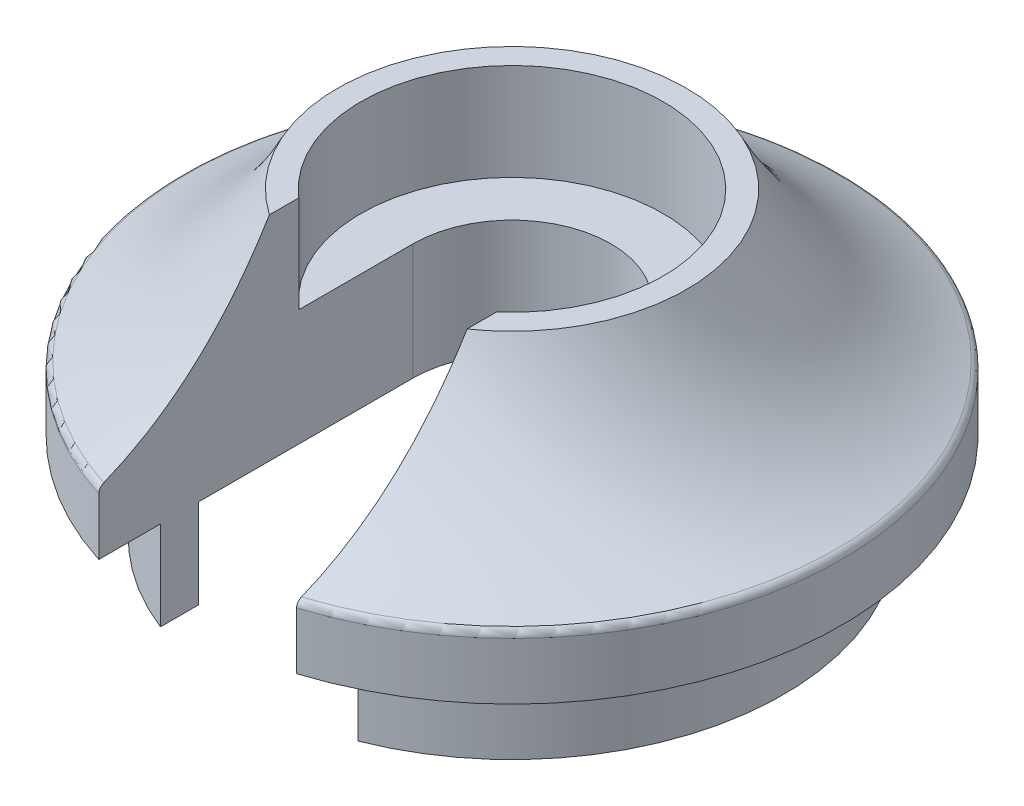
ISO-10303-21;
HEADER;
FILE_DESCRIPTION(('STEP AP214'),'2;1');
FILE_NAME('part.step','',(''),(''),'','','');
FILE_SCHEMA(('AUTOMOTIVE_DESIGN { 1 0 10303 214 1 1 1 1 }'));
ENDSEC;
DATA;
#1=APPLICATION_CONTEXT('core data for automotive mechanical design processes');
#2=APPLICATION_PROTOCOL_DEFINITION('international standard','automotive_design',2000,#1);
#3=PRODUCT_CONTEXT('',#1,'mechanical');
#4=PRODUCT('Part','Part','',(#3));
#5=PRODUCT_RELATED_PRODUCT_CATEGORY('part','',(#4));
#6=PRODUCT_DEFINITION_FORMATION('','',#4);
#7=PRODUCT_DEFINITION_CONTEXT('part definition',#1,'design');
#8=PRODUCT_DEFINITION('design','',#6,#7);
#9=PRODUCT_DEFINITION_SHAPE('','',#8);
#10=(LENGTH_UNIT() NAMED_UNIT(*) SI_UNIT(.MILLI.,.METRE.));
#11=(NAMED_UNIT(*) PLANE_ANGLE_UNIT() SI_UNIT($,.RADIAN.));
#12=(NAMED_UNIT(*) SI_UNIT($,.STERADIAN.) SOLID_ANGLE_UNIT());
#13=UNCERTAINTY_MEASURE_WITH_UNIT(LENGTH_MEASURE(1.E-05),#10,'distance_accuracy_value','');
#14=(GEOMETRIC_REPRESENTATION_CONTEXT(3) GLOBAL_UNCERTAINTY_ASSIGNED_CONTEXT((#13)) GLOBAL_UNIT_ASSIGNED_CONTEXT((#10,
#11,#12)) REPRESENTATION_CONTEXT('',''));
#15=CARTESIAN_POINT('',(0.,0.,0.));
#16=DIRECTION('',(0.,0.,1.));
#17=DIRECTION('',(1.,0.,0.));
#18=AXIS2_PLACEMENT_3D('',#15,#16,#17);
#19=CARTESIAN_POINT('',(0.,2.3,0.));
#20=DIRECTION('',(0.,1.,0.));
#21=DIRECTION('',(0.,0.,1.));
#22=AXIS2_PLACEMENT_3D('',#19,#20,#21);
#23=PLANE('',#22);
#24=CARTESIAN_POINT('',(0.,2.3,0.));
#25=DIRECTION('',(0.,-1.,0.));
#26=DIRECTION('',(0.,0.,-1.));
#27=AXIS2_PLACEMENT_3D('',#24,#25,#26);
#28=CIRCLE('',#27,8.5);
#29=CARTESIAN_POINT('',(2.55,2.3,8.10848321204404));
#30=VERTEX_POINT('',#29);
#31=CARTESIAN_POINT('',(-2.55,2.3,8.10848321204404));
#32=VERTEX_POINT('',#31);
#33=EDGE_CURVE('E20',#30,#32,#28,.F.);
#34=ORIENTED_EDGE('',*,*,#33,.F.);
#35=DIRECTION('',(0.,0.,1.));
#36=VECTOR('',#35,1.);
#37=CARTESIAN_POINT('',(2.55,2.3,0.));
#38=LINE('',#37,#36);
#39=CARTESIAN_POINT('',(2.55,2.3,6.51901066113563));
#40=VERTEX_POINT('',#39);
#41=EDGE_CURVE('E107',#40,#30,#38,.T.);
#42=ORIENTED_EDGE('',*,*,#41,.F.);
#43=CARTESIAN_POINT('',(0.,2.3,0.));
#44=DIRECTION('',(0.,-1.,0.));
#45=DIRECTION('',(0.,0.,-1.));
#46=AXIS2_PLACEMENT_3D('',#43,#44,#45);
#47=CIRCLE('',#46,7.);
#48=CARTESIAN_POINT('',(-2.55,2.3,6.51901066113563));
#49=VERTEX_POINT('',#48);
#50=EDGE_CURVE('E369',#49,#40,#47,.T.);
#51=ORIENTED_EDGE('',*,*,#50,.F.);
#52=DIRECTION('',(0.,0.,1.));
#53=VECTOR('',#52,1.);
#54=CARTESIAN_POINT('',(-2.55,2.3,0.));
#55=LINE('',#54,#53);
#56=EDGE_CURVE('E103',#32,#49,#55,.F.);
#57=ORIENTED_EDGE('',*,*,#56,.F.);
#58=EDGE_LOOP('',(#34,#42,#51,#57));
#59=FACE_BOUND('',#58,.T.);
#60=ADVANCED_FACE('F17',(#59),#23,.F.);
#61=CARTESIAN_POINT('',(0.,0.,0.));
#62=DIRECTION('',(0.,1.,0.));
#63=DIRECTION('',(0.,0.,1.));
#64=AXIS2_PLACEMENT_3D('',#61,#62,#63);
#65=PLANE('',#64);
#66=DIRECTION('',(0.,0.,1.));
#67=VECTOR('',#66,1.);
#68=CARTESIAN_POINT('',(-2.55,0.,0.));
#69=LINE('',#68,#67);
#70=CARTESIAN_POINT('',(-2.55,0.,6.51901066113563));
#71=VERTEX_POINT('',#70);
#72=CARTESIAN_POINT('',(-2.55,0.,5.54143483224336));
#73=VERTEX_POINT('',#72);
#74=EDGE_CURVE('E126',#71,#73,#69,.F.);
#75=ORIENTED_EDGE('',*,*,#74,.F.);
#76=CARTESIAN_POINT('',(0.,0.,0.));
#77=DIRECTION('',(0.,-1.,0.));
#78=DIRECTION('',(0.,0.,-1.));
#79=AXIS2_PLACEMENT_3D('',#76,#77,#78);
#80=CIRCLE('',#79,7.);
#81=CARTESIAN_POINT('',(2.55,0.,6.51901066113563));
#82=VERTEX_POINT('',#81);
#83=EDGE_CURVE('E365',#82,#71,#80,.F.);
#84=ORIENTED_EDGE('',*,*,#83,.F.);
#85=DIRECTION('',(0.,0.,1.));
#86=VECTOR('',#85,1.);
#87=CARTESIAN_POINT('',(2.55,0.,0.));
#88=LINE('',#87,#86);
#89=CARTESIAN_POINT('',(2.55,0.,5.54143483224336));
#90=VERTEX_POINT('',#89);
#91=EDGE_CURVE('E129',#90,#82,#88,.T.);
#92=ORIENTED_EDGE('',*,*,#91,.F.);
#93=CARTESIAN_POINT('',(0.,0.,0.));
#94=DIRECTION('',(0.,-1.,0.));
#95=DIRECTION('',(0.,0.,-1.));
#96=AXIS2_PLACEMENT_3D('',#93,#94,#95);
#97=CIRCLE('',#96,6.1);
#98=EDGE_CURVE('E367',#90,#73,#97,.F.);
#99=ORIENTED_EDGE('',*,*,#98,.T.);
#100=EDGE_LOOP('',(#75,#84,#92,#99));
#101=FACE_BOUND('',#100,.T.);
#102=ADVANCED_FACE('F316',(#101),#65,.F.);
#103=CARTESIAN_POINT('',(0.,3.9,0.));
#104=DIRECTION('',(0.,-1.,0.));
#105=DIRECTION('',(0.,0.,-1.));
#106=AXIS2_PLACEMENT_3D('',#103,#104,#105);
#107=CYLINDRICAL_SURFACE('',#106,8.5);
#108=ORIENTED_EDGE('',*,*,#33,.T.);
#109=DIRECTION('',(0.,-1.,0.));
#110=VECTOR('',#109,1.);
#111=CARTESIAN_POINT('',(-2.55,3.9,8.10848321204404));
#112=LINE('',#111,#110);
#113=CARTESIAN_POINT('',(-2.55,3.76648141199334,8.10848321204404));
#114=VERTEX_POINT('',#113);
#115=EDGE_CURVE('E111',#32,#114,#112,.F.);
#116=ORIENTED_EDGE('',*,*,#115,.T.);
#117=CARTESIAN_POINT('',(0.,3.76648141199396,0.));
#118=DIRECTION('',(0.,-1.,0.));
#119=DIRECTION('',(0.,0.,-1.));
#120=AXIS2_PLACEMENT_3D('',#117,#118,#119);
#121=CIRCLE('',#120,8.5);
#122=CARTESIAN_POINT('',(2.55,3.76648141199396,8.10848321204404));
#123=VERTEX_POINT('',#122);
#124=EDGE_CURVE('E125',#123,#114,#121,.F.);
#125=ORIENTED_EDGE('',*,*,#124,.F.);
#126=DIRECTION('',(0.,-1.,0.));
#127=VECTOR('',#126,1.);
#128=CARTESIAN_POINT('',(2.55,3.9,8.10848321204404));
#129=LINE('',#128,#127);
#130=EDGE_CURVE('E112',#123,#30,#129,.T.);
#131=ORIENTED_EDGE('',*,*,#130,.T.);
#132=EDGE_LOOP('',(#108,#116,#125,#131));
#133=FACE_BOUND('',#132,.T.);
#134=ADVANCED_FACE('F123',(#133),#107,.T.);
#135=CARTESIAN_POINT('',(0.,2.3,0.));
#136=DIRECTION('',(0.,-1.,0.));
#137=DIRECTION('',(0.,0.,-1.));
#138=AXIS2_PLACEMENT_3D('',#135,#136,#137);
#139=CYLINDRICAL_SURFACE('',#138,7.);
#140=DIRECTION('',(0.,1.,0.));
#141=VECTOR('',#140,1.);
#142=CARTESIAN_POINT('',(2.55,10.,6.51901066113563));
#143=LINE('',#142,#141);
#144=EDGE_CURVE('E121',#82,#40,#143,.T.);
#145=ORIENTED_EDGE('',*,*,#144,.F.);
#146=ORIENTED_EDGE('',*,*,#83,.T.);
#147=DIRECTION('',(0.,1.,0.));
#148=VECTOR('',#147,1.);
#149=CARTESIAN_POINT('',(-2.55,10.,6.51901066113563));
#150=LINE('',#149,#148);
#151=EDGE_CURVE('E139',#49,#71,#150,.F.);
#152=ORIENTED_EDGE('',*,*,#151,.F.);
#153=ORIENTED_EDGE('',*,*,#50,.T.);
#154=EDGE_LOOP('',(#145,#146,#152,#153));
#155=FACE_BOUND('',#154,.T.);
#156=ADVANCED_FACE('F302',(#155),#139,.T.);
#157=CARTESIAN_POINT('',(0.,5.3,0.));
#158=DIRECTION('',(0.,1.,0.));
#159=DIRECTION('',(0.,0.,1.));
#160=AXIS2_PLACEMENT_3D('',#157,#158,#159);
#161=CYLINDRICAL_SURFACE('',#160,3.9);
#162=CARTESIAN_POINT('',(0.,5.3,0.));
#163=DIRECTION('',(0.,1.,0.));
#164=DIRECTION('',(0.,0.,1.));
#165=AXIS2_PLACEMENT_3D('',#162,#163,#164);
#166=CIRCLE('',#165,3.9);
#167=CARTESIAN_POINT('',(2.55,5.3,2.9508473359359));
#168=VERTEX_POINT('',#167);
#169=CARTESIAN_POINT('',(-2.55,5.3,2.9508473359359));
#170=VERTEX_POINT('',#169);
#171=EDGE_CURVE('E233',#168,#170,#166,.T.);
#172=ORIENTED_EDGE('',*,*,#171,.F.);
#173=DIRECTION('',(0.,1.,0.));
#174=VECTOR('',#173,1.);
#175=CARTESIAN_POINT('',(2.55,10.,2.9508473359359));
#176=LINE('',#175,#174);
#177=CARTESIAN_POINT('',(2.55,7.8,2.9508473359359));
#178=VERTEX_POINT('',#177);
#179=EDGE_CURVE('E212',#178,#168,#176,.F.);
#180=ORIENTED_EDGE('',*,*,#179,.F.);
#181=CARTESIAN_POINT('',(0.,7.8,0.));
#182=DIRECTION('',(0.,1.,0.));
#183=DIRECTION('',(0.,0.,1.));
#184=AXIS2_PLACEMENT_3D('',#181,#182,#183);
#185=CIRCLE('',#184,3.9);
#186=CARTESIAN_POINT('',(-2.55,7.8,2.9508473359359));
#187=VERTEX_POINT('',#186);
#188=EDGE_CURVE('E137',#187,#178,#185,.F.);
#189=ORIENTED_EDGE('',*,*,#188,.F.);
#190=DIRECTION('',(0.,1.,0.));
#191=VECTOR('',#190,1.);
#192=CARTESIAN_POINT('',(-2.55,10.,2.9508473359359));
#193=LINE('',#192,#191);
#194=EDGE_CURVE('E215',#170,#187,#193,.T.);
#195=ORIENTED_EDGE('',*,*,#194,.F.);
#196=EDGE_LOOP('',(#172,#180,#189,#195));
#197=FACE_BOUND('',#196,.T.);
#198=ADVANCED_FACE('F232',(#197),#161,.F.);
#199=CARTESIAN_POINT('',(0.,5.3,0.));
#200=DIRECTION('',(0.,1.,0.));
#201=DIRECTION('',(0.,0.,1.));
#202=AXIS2_PLACEMENT_3D('',#199,#200,#201);
#203=PLANE('',#202);
#204=CARTESIAN_POINT('',(0.,5.3,0.));
#205=DIRECTION('',(0.,-1.,0.));
#206=DIRECTION('',(0.,0.,-1.));
#207=AXIS2_PLACEMENT_3D('',#204,#205,#206);
#208=CIRCLE('',#207,2.55);
#209=CARTESIAN_POINT('',(-2.55,5.3,0.));
#210=VERTEX_POINT('',#209);
#211=CARTESIAN_POINT('',(2.55,5.3,0.));
#212=VERTEX_POINT('',#211);
#213=EDGE_CURVE('E371',#210,#212,#208,.T.);
#214=ORIENTED_EDGE('',*,*,#213,.T.);
#215=DIRECTION('',(0.,0.,1.));
#216=VECTOR('',#215,1.);
#217=CARTESIAN_POINT('',(2.55,5.3,11.3377187851519));
#218=LINE('',#217,#216);
#219=EDGE_CURVE('E204',#168,#212,#218,.F.);
#220=ORIENTED_EDGE('',*,*,#219,.F.);
#221=ORIENTED_EDGE('',*,*,#171,.T.);
#222=DIRECTION('',(0.,0.,-1.));
#223=VECTOR('',#222,1.);
#224=CARTESIAN_POINT('',(-2.55,5.3,0.));
#225=LINE('',#224,#223);
#226=EDGE_CURVE('E217',#210,#170,#225,.F.);
#227=ORIENTED_EDGE('',*,*,#226,.F.);
#228=EDGE_LOOP('',(#214,#220,#221,#227));
#229=FACE_BOUND('',#228,.T.);
#230=ADVANCED_FACE('F287',(#229),#203,.T.);
#231=CARTESIAN_POINT('',(0.,10.,0.));
#232=DIRECTION('',(0.,-1.,0.));
#233=DIRECTION('',(0.,0.,-1.));
#234=AXIS2_PLACEMENT_3D('',#231,#232,#233);
#235=CYLINDRICAL_SURFACE('',#234,2.55);
#236=ORIENTED_EDGE('',*,*,#213,.F.);
#237=DIRECTION('',(0.,1.,0.));
#238=VECTOR('',#237,1.);
#239=CARTESIAN_POINT('',(-2.55,10.,0.));
#240=LINE('',#239,#238);
#241=CARTESIAN_POINT('',(-2.55,2.3,0.));
#242=VERTEX_POINT('',#241);
#243=EDGE_CURVE('E220',#242,#210,#240,.T.);
#244=ORIENTED_EDGE('',*,*,#243,.F.);
#245=CARTESIAN_POINT('',(0.,2.3,0.));
#246=DIRECTION('',(0.,-1.,0.));
#247=DIRECTION('',(0.,0.,-1.));
#248=AXIS2_PLACEMENT_3D('',#245,#246,#247);
#249=CIRCLE('',#248,2.55);
#250=CARTESIAN_POINT('',(2.55,2.3,0.));
#251=VERTEX_POINT('',#250);
#252=EDGE_CURVE('E375',#242,#251,#249,.T.);
#253=ORIENTED_EDGE('',*,*,#252,.T.);
#254=DIRECTION('',(0.,1.,0.));
#255=VECTOR('',#254,1.);
#256=CARTESIAN_POINT('',(2.55,10.,0.));
#257=LINE('',#256,#255);
#258=EDGE_CURVE('E200',#212,#251,#257,.F.);
#259=ORIENTED_EDGE('',*,*,#258,.F.);
#260=EDGE_LOOP('',(#236,#244,#253,#259));
#261=FACE_BOUND('',#260,.T.);
#262=ADVANCED_FACE('F280',(#261),#235,.F.);
#263=CARTESIAN_POINT('',(0.,2.3,0.));
#264=DIRECTION('',(0.,1.,0.));
#265=DIRECTION('',(0.,0.,1.));
#266=AXIS2_PLACEMENT_3D('',#263,#264,#265);
#267=PLANE('',#266);
#268=DIRECTION('',(0.,0.,-1.));
#269=VECTOR('',#268,1.);
#270=CARTESIAN_POINT('',(-2.55,2.3,0.));
#271=LINE('',#270,#269);
#272=CARTESIAN_POINT('',(-2.55,2.3,5.54143483224336));
#273=VERTEX_POINT('',#272);
#274=EDGE_CURVE('E196',#273,#242,#271,.T.);
#275=ORIENTED_EDGE('',*,*,#274,.F.);
#276=CARTESIAN_POINT('',(0.,2.3,0.));
#277=DIRECTION('',(0.,-1.,0.));
#278=DIRECTION('',(0.,0.,-1.));
#279=AXIS2_PLACEMENT_3D('',#276,#277,#278);
#280=CIRCLE('',#279,6.1);
#281=CARTESIAN_POINT('',(2.55,2.3,5.54143483224336));
#282=VERTEX_POINT('',#281);
#283=EDGE_CURVE('E197',#273,#282,#280,.T.);
#284=ORIENTED_EDGE('',*,*,#283,.T.);
#285=DIRECTION('',(0.,0.,1.));
#286=VECTOR('',#285,1.);
#287=CARTESIAN_POINT('',(2.55,2.3,11.3377187851519));
#288=LINE('',#287,#286);
#289=EDGE_CURVE('E203',#251,#282,#288,.T.);
#290=ORIENTED_EDGE('',*,*,#289,.F.);
#291=ORIENTED_EDGE('',*,*,#252,.F.);
#292=EDGE_LOOP('',(#275,#284,#290,#291));
#293=FACE_BOUND('',#292,.T.);
#294=ADVANCED_FACE('F273',(#293),#267,.F.);
#295=CARTESIAN_POINT('',(0.,2.3,0.));
#296=DIRECTION('',(0.,-1.,0.));
#297=DIRECTION('',(0.,0.,-1.));
#298=AXIS2_PLACEMENT_3D('',#295,#296,#297);
#299=CYLINDRICAL_SURFACE('',#298,6.1);
#300=ORIENTED_EDGE('',*,*,#283,.F.);
#301=DIRECTION('',(0.,1.,0.));
#302=VECTOR('',#301,1.);
#303=CARTESIAN_POINT('',(-2.55,10.,5.54143483224336));
#304=LINE('',#303,#302);
#305=EDGE_CURVE('E141',#73,#273,#304,.T.);
#306=ORIENTED_EDGE('',*,*,#305,.F.);
#307=ORIENTED_EDGE('',*,*,#98,.F.);
#308=DIRECTION('',(0.,1.,0.));
#309=VECTOR('',#308,1.);
#310=CARTESIAN_POINT('',(2.55,10.,5.54143483224336));
#311=LINE('',#310,#309);
#312=EDGE_CURVE('E206',#282,#90,#311,.F.);
#313=ORIENTED_EDGE('',*,*,#312,.F.);
#314=EDGE_LOOP('',(#300,#306,#307,#313));
#315=FACE_BOUND('',#314,.T.);
#316=ADVANCED_FACE('F185',(#315),#299,.F.);
#317=CARTESIAN_POINT('',(0.,3.76648141199396,0.));
#318=DIRECTION('',(0.,-1.,0.));
#319=DIRECTION('',(0.,0.,-1.));
#320=AXIS2_PLACEMENT_3D('',#317,#318,#319);
#321=TOROIDAL_SURFACE('',#320,8.3,0.2);
#322=ORIENTED_EDGE('',*,*,#124,.T.);
#323=CARTESIAN_POINT('',(-2.55,3.95048873132012,7.98088497639752));
#324=CARTESIAN_POINT('',(-2.55000000000606,3.94608943075577,7.99175284790437));
#325=CARTESIAN_POINT('',(-2.55000000000374,3.94078543434994,8.00225947105237));
#326=CARTESIAN_POINT('',(-2.54999999999625,3.92850852843602,8.02226486082936));
#327=CARTESIAN_POINT('',(-2.54999999999108,3.92153353586983,8.0317623479704));
#328=CARTESIAN_POINT('',(-2.54999999999185,3.90605627055718,8.04944749798335));
#329=CARTESIAN_POINT('',(-2.54999999999782,3.89755191507776,8.05763334551387));
#330=CARTESIAN_POINT('',(-2.55000000000218,3.87924743645228,8.07239487166745));
#331=CARTESIAN_POINT('',(-2.55000000000057,3.86944788074072,8.0789712518298));
#332=CARTESIAN_POINT('',(-2.54999999999944,3.84919107699408,8.09007630392045));
#333=CARTESIAN_POINT('',(-2.54999999999984,3.83876849849181,8.09466816991786));
#334=CARTESIAN_POINT('',(-2.55000000000016,3.81728895525437,8.10194846995746));
#335=CARTESIAN_POINT('',(-2.55000000000007,3.80623275612667,8.1046391508906));
#336=CARTESIAN_POINT('',(-2.54999999999994,3.78558301932294,8.10776737868022));
#337=CARTESIAN_POINT('',(-2.54999999999989,3.77603214991371,8.10849219195888));
#338=CARTESIAN_POINT('',(-2.55,3.76648141199334,8.10848321204404));
#339=B_SPLINE_CURVE_WITH_KNOTS('',3,(#323,#324,#325,#326,#327,#328,#329,#330,#331,#332,#333,
#334,#335,#336,#337,#338),.UNSPECIFIED.,.F.,.F.,(4,2,2,2,2,2,2,4),(0.,0.0351422007478165,
0.0703284397100562,0.105562964321535,0.140782103342877,0.174777873263789,0.208733398217077,
0.237361594882896),.UNSPECIFIED.);
#340=CARTESIAN_POINT('',(-2.54999999999999,3.95048873132013,7.98088497639749));
#341=VERTEX_POINT('',#340);
#342=EDGE_CURVE('E142',#341,#114,#339,.T.);
#343=ORIENTED_EDGE('',*,*,#342,.F.);
#344=CARTESIAN_POINT('',(0.,3.95048873132014,0.));
#345=DIRECTION('',(0.,1.,0.));
#346=DIRECTION('',(0.271810191276541,0.,0.96235088191273));
#347=AXIS2_PLACEMENT_3D('',#344,#345,#346);
#348=CIRCLE('',#347,8.37836648795495);
#349=CARTESIAN_POINT('',(2.55,3.95048873132015,7.98088497639745));
#350=VERTEX_POINT('',#349);
#351=EDGE_CURVE('E209',#350,#341,#348,.T.);
#352=ORIENTED_EDGE('',*,*,#351,.F.);
#353=CARTESIAN_POINT('',(2.55,3.76648141199397,8.10848321204404));
#354=CARTESIAN_POINT('',(2.55000000000001,3.77735634534538,8.10849484426214));
#355=CARTESIAN_POINT('',(2.55000000000001,3.78822547769531,8.10755418963548));
#356=CARTESIAN_POINT('',(2.54999999999999,3.80962950645313,8.10385746462359));
#357=CARTESIAN_POINT('',(2.54999999999999,3.82016501537511,8.10110495086834));
#358=CARTESIAN_POINT('',(2.55000000000001,3.84062395890147,8.09387308103904));
#359=CARTESIAN_POINT('',(2.55000000000004,3.85054740122184,8.08939374673925));
#360=CARTESIAN_POINT('',(2.54999999999996,3.86952221806827,8.07886352649235));
#361=CARTESIAN_POINT('',(2.54999999999985,3.87857342388374,8.07281233734551));
#362=CARTESIAN_POINT('',(2.54999999999985,3.89573867930464,8.05920575342146));
#363=CARTESIAN_POINT('',(2.54999999999996,3.90383211625159,8.05162442350813));
#364=CARTESIAN_POINT('',(2.55000000000004,3.91870789934265,8.0352485909189));
#365=CARTESIAN_POINT('',(2.55,3.92548843084205,8.02645243751049));
#366=CARTESIAN_POINT('',(2.54999999999999,3.93527381775863,8.01144888534434));
#367=CARTESIAN_POINT('',(2.54999999999999,3.93873298476125,8.00553188831957));
#368=CARTESIAN_POINT('',(2.55000000000001,3.94505654607858,7.99341227075734));
#369=CARTESIAN_POINT('',(2.55000000000001,3.94792281766703,7.98721063013055));
#370=CARTESIAN_POINT('',(2.55,3.95048873132015,7.98088497639745));
#371=B_SPLINE_CURVE_WITH_KNOTS('',3,(#353,#354,#355,#356,#357,#358,#359,#360,#361,#362,#363,
#364,#365,#366,#367,#368,#369,#370),.UNSPECIFIED.,.F.,.F.,(4,2,2,2,2,2,2,2,4),(0.,
0.0325753343869618,0.0650869142104483,0.0975980840939448,0.130115529816097,0.163239081053525,
0.196408092539201,0.216940848935675,0.237407562600284),.UNSPECIFIED.);
#372=EDGE_CURVE('E136',#123,#350,#371,.T.);
#373=ORIENTED_EDGE('',*,*,#372,.F.);
#374=EDGE_LOOP('',(#322,#343,#352,#373));
#375=FACE_BOUND('',#374,.T.);
#376=ADVANCED_FACE('F179',(#375),#321,.T.);
#377=CARTESIAN_POINT('',(-2.55,10.,0.));
#378=DIRECTION('',(1.,0.,0.));
#379=DIRECTION('',(0.,0.,-1.));
#380=AXIS2_PLACEMENT_3D('',#377,#378,#379);
#381=PLANE('',#380);
#382=ORIENTED_EDGE('',*,*,#74,.T.);
#383=ORIENTED_EDGE('',*,*,#305,.T.);
#384=ORIENTED_EDGE('',*,*,#274,.T.);
#385=ORIENTED_EDGE('',*,*,#243,.T.);
#386=ORIENTED_EDGE('',*,*,#226,.T.);
#387=ORIENTED_EDGE('',*,*,#194,.T.);
#388=DIRECTION('',(0.,0.,1.));
#389=VECTOR('',#388,1.);
#390=CARTESIAN_POINT('',(-2.55,7.8,0.));
#391=LINE('',#390,#389);
#392=CARTESIAN_POINT('',(-2.55,7.8,3.70776212829248));
#393=VERTEX_POINT('',#392);
#394=EDGE_CURVE('E193',#393,#187,#391,.F.);
#395=ORIENTED_EDGE('',*,*,#394,.F.);
#396=CARTESIAN_POINT('',(-2.54999999999997,3.95048873132014,7.98088497639746));
#397=CARTESIAN_POINT('',(-2.54999999999999,3.99080367033136,7.8815018371555));
#398=CARTESIAN_POINT('',(-2.55,4.03313209485207,7.78294731159661));
#399=CARTESIAN_POINT('',(-2.55,4.12178328837618,7.58765091803453));
#400=CARTESIAN_POINT('',(-2.55,4.16810608315415,7.49090906173288));
#401=CARTESIAN_POINT('',(-2.55,4.31296643686506,7.2037363296864));
#402=CARTESIAN_POINT('',(-2.55,4.41743762098327,7.01625545378082));
#403=CARTESIAN_POINT('',(-2.55,4.64042727399274,6.65202750132538));
#404=CARTESIAN_POINT('',(-2.55,4.75882195478071,6.47520425046498));
#405=CARTESIAN_POINT('',(-2.55,5.00918016178607,6.13147639860101));
#406=CARTESIAN_POINT('',(-2.55,5.14114158688359,5.96457026800417));
#407=CARTESIAN_POINT('',(-2.55,5.36696012760689,5.70002875629));
#408=CARTESIAN_POINT('',(-2.55,5.45721196022277,5.59928500888923));
#409=CARTESIAN_POINT('',(-2.55,5.64222431407029,5.40205998112382));
#410=CARTESIAN_POINT('',(-2.55,5.73698417619158,5.30557808159642));
#411=CARTESIAN_POINT('',(-2.55,6.02775308244498,5.02222424123633));
#412=CARTESIAN_POINT('',(-2.55,6.2300161232591,4.84171751688469));
#413=CARTESIAN_POINT('',(-2.55,6.65380766322032,4.49241824966296));
#414=CARTESIAN_POINT('',(-2.55,6.87571581994707,4.32409193639606));
#415=CARTESIAN_POINT('',(-2.55,7.33034182002966,4.00399830514954));
#416=CARTESIAN_POINT('',(-2.55,7.56302998029856,3.85218896969218));
#417=CARTESIAN_POINT('',(-2.55,7.8,3.70776212829248));
#418=B_SPLINE_CURVE_WITH_KNOTS('',3,(#396,#397,#398,#399,#400,#401,#402,#403,#404,#405,#406,
#407,#408,#409,#410,#411,#412,#413,#414,#415,#416,#417),.UNSPECIFIED.,.F.,.F.,(4,2,2,2,2,2,2,2,
2,2,4),(0.,0.321701563356563,0.643405202718693,1.28648063856435,1.92421860453366,
2.56185795059219,2.96749681933997,3.37307656159344,4.18531421699906,5.02017211544845,
5.85285395471111),.UNSPECIFIED.);
#419=EDGE_CURVE('E173',#341,#393,#418,.T.);
#420=ORIENTED_EDGE('',*,*,#419,.F.);
#421=ORIENTED_EDGE('',*,*,#342,.T.);
#422=ORIENTED_EDGE('',*,*,#115,.F.);
#423=ORIENTED_EDGE('',*,*,#56,.T.);
#424=ORIENTED_EDGE('',*,*,#151,.T.);
#425=EDGE_LOOP('',(#382,#383,#384,#385,#386,#387,#395,#420,#421,#422,#423,#424));
#426=FACE_BOUND('',#425,.T.);
#427=ADVANCED_FACE('F184',(#426),#381,.T.);
#428=CARTESIAN_POINT('',(0.,7.8,0.));
#429=DIRECTION('',(0.,1.,0.));
#430=DIRECTION('',(0.,0.,1.));
#431=AXIS2_PLACEMENT_3D('',#428,#429,#430);
#432=PLANE('',#431);
#433=ORIENTED_EDGE('',*,*,#188,.T.);
#434=DIRECTION('',(0.,0.,1.));
#435=VECTOR('',#434,1.);
#436=CARTESIAN_POINT('',(2.55,7.8,11.3377187851519));
#437=LINE('',#436,#435);
#438=CARTESIAN_POINT('',(2.55,7.8,3.70776212829248));
#439=VERTEX_POINT('',#438);
#440=EDGE_CURVE('E35',#439,#178,#437,.F.);
#441=ORIENTED_EDGE('',*,*,#440,.F.);
#442=CARTESIAN_POINT('',(-2.55,7.8,3.70776212829248));
#443=CARTESIAN_POINT('',(-2.65428970170244,7.8,3.63605377867095));
#444=CARTESIAN_POINT('',(-2.75553698944585,7.8,3.55992513713049));
#445=CARTESIAN_POINT('',(-2.95125960276414,7.8,3.39941913191996));
#446=CARTESIAN_POINT('',(-3.04573525235649,7.8,3.31504216338304));
#447=CARTESIAN_POINT('',(-3.22717376243014,7.8,3.13868640913532));
#448=CARTESIAN_POINT('',(-3.3141418587151,7.8,3.04671301025179));
#449=CARTESIAN_POINT('',(-3.48002349370043,7.8,2.85577097228434));
#450=CARTESIAN_POINT('',(-3.5589371302618,7.8,2.75680241821569));
#451=CARTESIAN_POINT('',(-3.70817107127348,7.8,2.55254202237628));
#452=CARTESIAN_POINT('',(-3.77848890791658,7.8,2.44724837758583));
#453=CARTESIAN_POINT('',(-3.91002961494267,7.8,2.23107214645913));
#454=CARTESIAN_POINT('',(-3.9712491154997,7.8,2.12018750960439));
#455=CARTESIAN_POINT('',(-4.08409459526803,7.8,1.89371803318472));
#456=CARTESIAN_POINT('',(-4.13572598054702,7.8,1.77813588730201));
#457=CARTESIAN_POINT('',(-4.22908841785949,7.8,1.54299044006925));
#458=CARTESIAN_POINT('',(-4.27081580889988,7.8,1.42342568512056));
#459=CARTESIAN_POINT('',(-4.34403624360962,7.8,1.18124782902187));
#460=CARTESIAN_POINT('',(-4.37553283151431,7.8,1.05863579941296));
#461=CARTESIAN_POINT('',(-4.42809738615603,7.8,0.811148945599491));
#462=CARTESIAN_POINT('',(-4.4491614976687,7.8,0.686273302542043));
#463=CARTESIAN_POINT('',(-4.48069044945291,7.8,0.435218651611807));
#464=CARTESIAN_POINT('',(-4.49115759042394,7.8,0.309039932660907));
#465=CARTESIAN_POINT('',(-4.50142813201146,7.8,0.0562024893176906));
#466=CARTESIAN_POINT('',(-4.50122759316474,7.8,-0.0704563951290354));
#467=CARTESIAN_POINT('',(-4.49015671654041,7.8,-0.323254409787084));
#468=CARTESIAN_POINT('',(-4.47929079289886,7.8,-0.449393733343589));
#469=CARTESIAN_POINT('',(-4.44696694397939,7.8,-0.700355290137305));
#470=CARTESIAN_POINT('',(-4.42550511001481,7.8,-0.825177019964083));
#471=CARTESIAN_POINT('',(-4.37215173771109,7.8,-1.07251473390124));
#472=CARTESIAN_POINT('',(-4.34026470665501,7.8,-1.19503169030372));
#473=CARTESIAN_POINT('',(-4.26627151888898,7.8,-1.43698924440735));
#474=CARTESIAN_POINT('',(-4.22416159398005,7.8,-1.55642868972722));
#475=CARTESIAN_POINT('',(-4.1300439607003,7.8,-1.79129435029405));
#476=CARTESIAN_POINT('',(-4.07803970274427,7.8,-1.90672194803143));
#477=CARTESIAN_POINT('',(-3.96447501008077,7.8,-2.13282717263206));
#478=CARTESIAN_POINT('',(-3.90291105417328,7.8,-2.24350302999701));
#479=CARTESIAN_POINT('',(-3.77069233347036,7.8,-2.45924202551463));
#480=CARTESIAN_POINT('',(-3.70004074207414,7.8,-2.56430710490977));
#481=CARTESIAN_POINT('',(-3.55013982564888,7.8,-2.76812965103624));
#482=CARTESIAN_POINT('',(-3.47088733586428,7.8,-2.86688477459893));
#483=CARTESIAN_POINT('',(-3.2210927514701,7.8,-3.15251911596136));
#484=CARTESIAN_POINT('',(-3.03836861318805,7.8,-3.32900330218868));
#485=CARTESIAN_POINT('',(-2.64598078580038,7.8,-3.64868771340371));
#486=CARTESIAN_POINT('',(-2.43631725855959,7.8,-3.79188813836175));
#487=CARTESIAN_POINT('',(-1.9958988720711,7.8,-4.04108448837409));
#488=CARTESIAN_POINT('',(-1.76514396514822,7.8,-4.14708032932815));
#489=CARTESIAN_POINT('',(-1.28912063892541,7.8,-4.31881996115168));
#490=CARTESIAN_POINT('',(-1.04385219804001,7.8,-4.38456369215397));
#491=CARTESIAN_POINT('',(-0.545757572945179,7.8,-4.47394299780202));
#492=CARTESIAN_POINT('',(-0.292931394326279,7.8,-4.49757860359482));
#493=CARTESIAN_POINT('',(0.213100460854438,7.8,-4.50206733511083));
#494=CARTESIAN_POINT('',(0.466306137413252,7.8,-4.4829204611727));
#495=CARTESIAN_POINT('',(0.965907927697716,7.8,-4.40239117498869));
#496=CARTESIAN_POINT('',(1.21230403630579,7.8,-4.34100873100255));
#497=CARTESIAN_POINT('',(1.69129903359167,7.8,-4.17774054412733));
#498=CARTESIAN_POINT('',(1.92389794289709,7.8,-4.07585486179471));
#499=CARTESIAN_POINT('',(2.36866762456516,7.8,-3.83451054372517));
#500=CARTESIAN_POINT('',(2.58083844504493,7.8,-3.69505199649178));
#501=CARTESIAN_POINT('',(2.97883557739623,7.8,-3.38237866463195));
#502=CARTESIAN_POINT('',(3.16466172576275,7.8,-3.20916367051604));
#503=CARTESIAN_POINT('',(3.419484085781,7.8,-2.92800543306007));
#504=CARTESIAN_POINT('',(3.50047601961278,7.8,-2.83067168751857));
#505=CARTESIAN_POINT('',(3.65396914431607,7.8,-2.62954025132479));
#506=CARTESIAN_POINT('',(3.72647345788761,7.8,-2.52574495962042));
#507=CARTESIAN_POINT('',(3.86249845497727,7.8,-2.31238539349203));
#508=CARTESIAN_POINT('',(3.92601601112147,7.8,-2.20281912889391));
#509=CARTESIAN_POINT('',(4.043573745422,7.8,-1.97876419762942));
#510=CARTESIAN_POINT('',(4.0976174128419,7.8,-1.86427736265114));
#511=CARTESIAN_POINT('',(4.1958864626278,7.8,-1.63111867643807));
#512=CARTESIAN_POINT('',(4.24010844259275,7.8,-1.51244539139159));
#513=CARTESIAN_POINT('',(4.31838202462389,7.8,-1.27183924293015));
#514=CARTESIAN_POINT('',(4.35243737380009,7.8,-1.14990759854474));
#515=CARTESIAN_POINT('',(4.41017012295135,7.8,-0.903555296416988));
#516=CARTESIAN_POINT('',(4.43384297240085,7.8,-0.779133572233319));
#517=CARTESIAN_POINT('',(4.47061384079623,7.8,-0.528784186680444));
#518=CARTESIAN_POINT('',(4.48371575884729,7.8,-0.402857097976143));
#519=CARTESIAN_POINT('',(4.49926952395524,7.8,-0.150293344304656));
#520=CARTESIAN_POINT('',(4.50171686264218,7.8,-0.0236564016595753));
#521=CARTESIAN_POINT('',(4.49593281951297,7.8,0.229326524367564));
#522=CARTESIAN_POINT('',(4.48770537957351,7.8,0.35567259790317));
#523=CARTESIAN_POINT('',(4.4606344586934,7.8,0.607246993479925));
#524=CARTESIAN_POINT('',(4.4417889307666,7.8,0.732475095264997));
#525=CARTESIAN_POINT('',(4.39362327841332,7.8,0.980852397079923));
#526=CARTESIAN_POINT('',(4.36430702263914,7.8,1.10400234735519));
#527=CARTESIAN_POINT('',(4.29539618868078,7.8,1.34743402615869));
#528=CARTESIAN_POINT('',(4.25579838694676,7.8,1.46771484219678));
#529=CARTESIAN_POINT('',(4.16662694490875,7.8,1.70446918956526));
#530=CARTESIAN_POINT('',(4.11705698091699,7.8,1.82094410562846));
#531=CARTESIAN_POINT('',(4.00824875520079,7.8,2.04937974396385));
#532=CARTESIAN_POINT('',(3.94900427763098,7.8,2.16133750592268));
#533=CARTESIAN_POINT('',(3.82131512009328,7.8,2.37982274874264));
#534=CARTESIAN_POINT('',(3.75287366611797,7.8,2.48635211571381));
#535=CARTESIAN_POINT('',(3.60347732339316,7.8,2.69863997222774));
#536=CARTESIAN_POINT('',(3.52205740092856,7.8,2.80407163357506));
#537=CARTESIAN_POINT('',(3.35019246053826,7.8,3.00731218115888));
#538=CARTESIAN_POINT('',(3.25974684913902,7.8,3.10512056538166));
#539=CARTESIAN_POINT('',(3.07042655760115,7.8,3.29244964834079));
#540=CARTESIAN_POINT('',(2.97154174677069,7.8,3.38196010937786));
#541=CARTESIAN_POINT('',(2.76622948698297,7.8,3.55186865004238));
#542=CARTESIAN_POINT('',(2.65980194638636,7.8,3.63226661892803));
#543=CARTESIAN_POINT('',(2.55000000000003,7.8,3.70776212829246));
#544=B_SPLINE_CURVE_WITH_KNOTS('',3,(#442,#443,#444,#445,#446,#447,#448,#449,#450,#451,#452,
#453,#454,#455,#456,#457,#458,#459,#460,#461,#462,#463,#464,#465,#466,#467,#468,#469,#470,#471,
#472,#473,#474,#475,#476,#477,#478,#479,#480,#481,#482,#483,#484,#485,#486,#487,#488,#489,#490,
#491,#492,#493,#494,#495,#496,#497,#498,#499,#500,#501,#502,#503,#504,#505,#506,#507,#508,#509,
#510,#511,#512,#513,#514,#515,#516,#517,#518,#519,#520,#521,#522,#523,#524,#525,#526,#527,#528,
#529,#530,#531,#532,#533,#534,#535,#536,#537,#538,#539,#540,#541,#542,#543),.UNSPECIFIED.,.F.,
.F.,(4,2,2,2,2,2,2,2,2,2,2,2,2,2,2,2,2,2,2,2,2,2,2,2,2,2,2,2,2,2,2,2,2,2,2,2,2,2,2,2,2,2,2,2,2,
2,2,2,2,2,4),(0.,0.379575907427224,0.759133640308909,1.13842449248672,1.51771073576406,
1.89710561557787,2.27664066667809,2.65596107043329,3.03542147165854,3.41475027667737,
3.79421915472206,4.17360562891469,4.55313220755825,4.93250177584527,5.31201139306731,
5.69135714765763,6.07084294346447,6.45019664432656,6.82969040848081,7.20905201149428,
7.58855367937185,8.34673664921366,9.10491506374007,9.86309519210282,10.6212764481083,
11.3794571432932,12.1376378324766,12.8958190914377,13.6539992168449,14.4121775563609,
15.1703606012131,15.5498625029169,15.9292243394393,16.3087178701223,16.6880713371204,
17.0675560144031,17.4469006520369,17.8264113861452,18.2057820730264,18.5853132709157,
18.9647043591576,19.3441686125644,19.7234928089234,20.1029360778485,20.4822397176752,
20.861788024766,21.2412035448058,21.6403065949661,22.0394359049904,22.4390512701222,
22.8386714911576),.UNSPECIFIED.);
#545=EDGE_CURVE('E26',#393,#439,#544,.T.);
#546=ORIENTED_EDGE('',*,*,#545,.F.);
#547=ORIENTED_EDGE('',*,*,#394,.T.);
#548=EDGE_LOOP('',(#433,#441,#546,#547));
#549=FACE_BOUND('',#548,.T.);
#550=ADVANCED_FACE('F162',(#549),#432,.T.);
#551=CARTESIAN_POINT('',(2.55,10.,11.3377187851519));
#552=DIRECTION('',(-1.,0.,0.));
#553=DIRECTION('',(0.,0.,1.));
#554=AXIS2_PLACEMENT_3D('',#551,#552,#553);
#555=PLANE('',#554);
#556=ORIENTED_EDGE('',*,*,#289,.T.);
#557=ORIENTED_EDGE('',*,*,#312,.T.);
#558=ORIENTED_EDGE('',*,*,#91,.T.);
#559=ORIENTED_EDGE('',*,*,#144,.T.);
#560=ORIENTED_EDGE('',*,*,#41,.T.);
#561=ORIENTED_EDGE('',*,*,#130,.F.);
#562=ORIENTED_EDGE('',*,*,#372,.T.);
#563=CARTESIAN_POINT('',(2.55,7.8,3.70776212829248));
#564=CARTESIAN_POINT('',(2.55,7.54093902267788,3.8656412519083));
#565=CARTESIAN_POINT('',(2.55,7.28693309710049,4.03240380092935));
#566=CARTESIAN_POINT('',(2.55,6.79219044033016,4.38569880098263));
#567=CARTESIAN_POINT('',(2.55,6.55148733798134,4.57227815756668));
#568=CARTESIAN_POINT('',(2.55,6.12910784040133,4.93134519133545));
#569=CARTESIAN_POINT('',(2.55,5.94455560383023,5.10042083156442));
#570=CARTESIAN_POINT('',(2.55,5.67872441274381,5.36478140753434));
#571=CARTESIAN_POINT('',(2.55,5.59199983508513,5.45463072088779));
#572=CARTESIAN_POINT('',(2.55,5.42244526873265,5.63795992440424));
#573=CARTESIAN_POINT('',(2.55,5.33961587906112,5.73144036897139));
#574=CARTESIAN_POINT('',(2.55,5.12313897061795,5.98694202777329));
#575=CARTESIAN_POINT('',(2.55,4.99333293476116,6.15225317460772));
#576=CARTESIAN_POINT('',(2.55,4.7470022891183,6.49252947934306));
#577=CARTESIAN_POINT('',(2.55,4.63048011091176,6.66749639603936));
#578=CARTESIAN_POINT('',(2.55,4.41093298269536,7.02772561258764));
#579=CARTESIAN_POINT('',(2.55,4.30802700705916,7.21306079233038));
#580=CARTESIAN_POINT('',(2.55,4.16523248157655,7.49685336343347));
#581=CARTESIAN_POINT('',(2.55,4.11955257686985,7.59243840784548));
#582=CARTESIAN_POINT('',(2.55,4.03209001966643,7.78537457503498));
#583=CARTESIAN_POINT('',(2.55,3.99030733743839,7.88272568433266));
#584=CARTESIAN_POINT('',(2.55,3.95048873132014,7.98088497639745));
#585=B_SPLINE_CURVE_WITH_KNOTS('',3,(#563,#564,#565,#566,#567,#568,#569,#570,#571,#572,#573,
#574,#575,#576,#577,#578,#579,#580,#581,#582,#583,#584),.UNSPECIFIED.,.F.,.F.,(4,2,2,2,2,2,2,2,
2,2,4),(0.,0.910432859907254,1.82307084064465,2.57310630773553,2.94763606326879,
3.32222322883506,3.95211911962883,4.5821301269065,5.21732611662254,5.53506967966432,
5.85281081848902),.UNSPECIFIED.);
#586=EDGE_CURVE('E11',#439,#350,#585,.T.);
#587=ORIENTED_EDGE('',*,*,#586,.F.);
#588=ORIENTED_EDGE('',*,*,#440,.T.);
#589=ORIENTED_EDGE('',*,*,#179,.T.);
#590=ORIENTED_EDGE('',*,*,#219,.T.);
#591=ORIENTED_EDGE('',*,*,#258,.T.);
#592=EDGE_LOOP('',(#556,#557,#558,#559,#560,#561,#562,#587,#588,#589,#590,#591));
#593=FACE_BOUND('',#592,.T.);
#594=ADVANCED_FACE('F117',(#593),#555,.T.);
#595=CARTESIAN_POINT('',(1.22314586074443,7.8,4.33057896860729));
#596=CARTESIAN_POINT('',(7.95510922584044,7.8,2.42917659622463));
#597=CARTESIAN_POINT('',(6.99533142393532,7.8,-4.50000000000002));
#598=CARTESIAN_POINT('',(0.,7.8,-4.5));
#599=CARTESIAN_POINT('',(-6.99533142393535,7.8,-4.49999999999998));
#600=CARTESIAN_POINT('',(-7.95510922584043,7.8,2.42917659622467));
#601=CARTESIAN_POINT('',(-1.22314586074441,7.8,4.33057896860729));
#602=CARTESIAN_POINT('',(1.60470222218137,5.00439351653812,5.68148895179723));
#603=CARTESIAN_POINT('',(10.4366795997922,5.00439351653812,3.18695031160074));
#604=CARTESIAN_POINT('',(9.17750224331555,5.00439351653812,-5.90376032129253));
#605=CARTESIAN_POINT('',(0.,5.00439351653812,-5.9037603212925));
#606=CARTESIAN_POINT('',(-9.17750224331557,5.00439351653812,-5.90376032129248));
#607=CARTESIAN_POINT('',(-10.4366795997921,5.00439351653812,3.18695031160079));
#608=CARTESIAN_POINT('',(-1.60470222218134,5.00439351653812,5.68148895179723));
#609=CARTESIAN_POINT('',(2.277325397676,3.95048873132014,8.06292837867151));
#610=CARTESIAN_POINT('',(14.8112934546228,3.95048873132014,4.52278484158509));
#611=CARTESIAN_POINT('',(13.0243223054306,3.95048873132014,-8.37836648795498));
#612=CARTESIAN_POINT('',(0.,3.95048873132014,-8.37836648795495));
#613=CARTESIAN_POINT('',(-13.0243223054307,3.95048873132014,-8.37836648795492));
#614=CARTESIAN_POINT('',(-14.8112934546228,3.95048873132014,4.52278484158516));
#615=CARTESIAN_POINT('',(-2.27732539767595,3.95048873132014,8.06292837867153));
#616=(BOUNDED_SURFACE() B_SPLINE_SURFACE(2,3,((#595,#596,#597,#598,#599,#600,#601),(#602,#603,
#604,#605,#606,#607,#608),(#609,#610,#611,#612,#613,#614,#615)),.UNSPECIFIED.,.F.,.F.,
.F.) B_SPLINE_SURFACE_WITH_KNOTS((3,3),(4,3,4),(0.,0.853327571810689),(0.,0.5,1.),
.UNSPECIFIED.) GEOMETRIC_REPRESENTATION_ITEM() RATIONAL_B_SPLINE_SURFACE(((1.,0.424801746930923,
0.424801746930923,1.,0.424801746930923,0.424801746930923,1.),(1.,0.424801746930923,
0.424801746930923,1.,0.424801746930923,0.424801746930923,1.),(1.,0.424801746930923,
0.424801746930923,1.,0.424801746930923,0.424801746930923,1.))) REPRESENTATION_ITEM('') SURFACE());
#617=ORIENTED_EDGE('',*,*,#545,.T.);
#618=ORIENTED_EDGE('',*,*,#586,.T.);
#619=ORIENTED_EDGE('',*,*,#351,.T.);
#620=ORIENTED_EDGE('',*,*,#419,.T.);
#621=EDGE_LOOP('',(#617,#618,#619,#620));
#622=FACE_BOUND('',#621,.T.);
#623=ADVANCED_FACE('F156',(#622),#616,.T.);
#624=CLOSED_SHELL('',(#60,#102,#134,#156,#198,#230,#262,#294,#316,#376,#427,#550,#594,#623));
#625=MANIFOLD_SOLID_BREP('B1',#624);
#626=ADVANCED_BREP_SHAPE_REPRESENTATION('',(#18,#625),#14);
#627=SHAPE_DEFINITION_REPRESENTATION(#9,#626);
ENDSEC;
END-ISO-10303-21;
